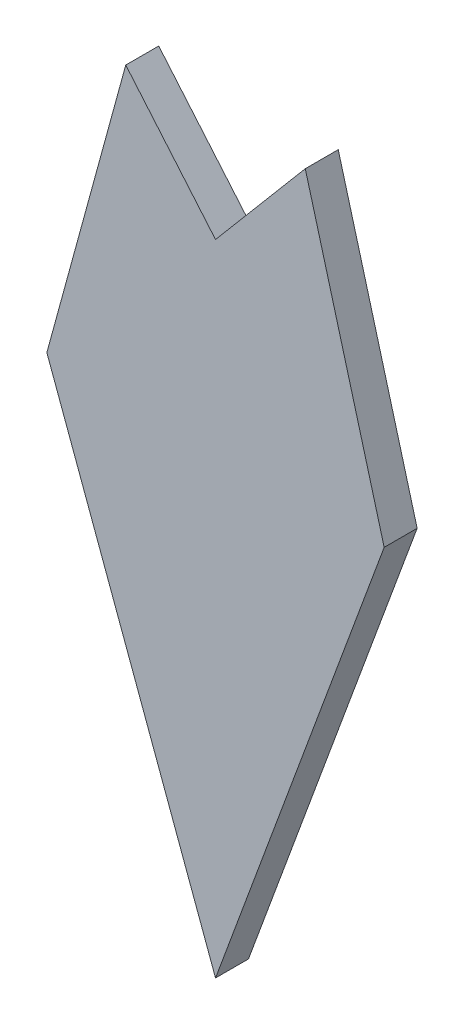
ISO-10303-21;
HEADER;
FILE_DESCRIPTION(('STEP AP214'),'2;1');
FILE_NAME('part.step','',(''),(''),'','','');
FILE_SCHEMA(('AUTOMOTIVE_DESIGN { 1 0 10303 214 1 1 1 1 }'));
ENDSEC;
DATA;
#1=APPLICATION_CONTEXT('core data for automotive mechanical design processes');
#2=APPLICATION_PROTOCOL_DEFINITION('international standard','automotive_design',2000,#1);
#3=PRODUCT_CONTEXT('',#1,'mechanical');
#4=PRODUCT('Part','Part','',(#3));
#5=PRODUCT_RELATED_PRODUCT_CATEGORY('part','',(#4));
#6=PRODUCT_DEFINITION_FORMATION('','',#4);
#7=PRODUCT_DEFINITION_CONTEXT('part definition',#1,'design');
#8=PRODUCT_DEFINITION('design','',#6,#7);
#9=PRODUCT_DEFINITION_SHAPE('','',#8);
#10=(LENGTH_UNIT() NAMED_UNIT(*) SI_UNIT(.MILLI.,.METRE.));
#11=(NAMED_UNIT(*) PLANE_ANGLE_UNIT() SI_UNIT($,.RADIAN.));
#12=(NAMED_UNIT(*) SI_UNIT($,.STERADIAN.) SOLID_ANGLE_UNIT());
#13=UNCERTAINTY_MEASURE_WITH_UNIT(LENGTH_MEASURE(1.E-05),#10,'distance_accuracy_value','');
#14=(GEOMETRIC_REPRESENTATION_CONTEXT(3) GLOBAL_UNCERTAINTY_ASSIGNED_CONTEXT((#13)) GLOBAL_UNIT_ASSIGNED_CONTEXT((#10,
#11,#12)) REPRESENTATION_CONTEXT('',''));
#15=CARTESIAN_POINT('',(0.,0.,0.));
#16=DIRECTION('',(0.,0.,1.));
#17=DIRECTION('',(1.,0.,0.));
#18=AXIS2_PLACEMENT_3D('',#15,#16,#17);
#19=CARTESIAN_POINT('',(28.0238736046993,7.66526392419233,0.5));
#20=DIRECTION('',(-0.964567933430015,-0.263834610691151,0.));
#21=DIRECTION('',(-0.263834610691151,0.964567933430015,0.));
#22=AXIS2_PLACEMENT_3D('',#19,#20,#21);
#23=PLANE('',#22);
#24=DIRECTION('',(-0.263834610691151,0.964567933430015,0.));
#25=VECTOR('',#24,1.);
#26=CARTESIAN_POINT('',(28.0238736046993,7.66526392419233,0.));
#27=LINE('',#26,#25);
#28=CARTESIAN_POINT('',(27.207956928254,10.6482200283522,0.));
#29=VERTEX_POINT('',#28);
#30=CARTESIAN_POINT('',(26.0112881478147,15.0231893681396,0.));
#31=VERTEX_POINT('',#30);
#32=EDGE_CURVE('E11',#29,#31,#27,.T.);
#33=ORIENTED_EDGE('',*,*,#32,.T.);
#34=DIRECTION('',(0.,0.,-1.));
#35=VECTOR('',#34,1.);
#36=CARTESIAN_POINT('',(26.0112881478147,15.0231893681396,0.5));
#37=LINE('',#36,#35);
#38=CARTESIAN_POINT('',(26.0112881478147,15.0231893681396,0.5));
#39=VERTEX_POINT('',#38);
#40=EDGE_CURVE('E42',#39,#31,#37,.T.);
#41=ORIENTED_EDGE('',*,*,#40,.F.);
#42=DIRECTION('',(-0.263834610691151,0.964567933430015,0.));
#43=VECTOR('',#42,1.);
#44=CARTESIAN_POINT('',(28.0238736046993,7.66526392419233,0.5));
#45=LINE('',#44,#43);
#46=CARTESIAN_POINT('',(27.207956928254,10.6482200283522,0.5));
#47=VERTEX_POINT('',#46);
#48=EDGE_CURVE('E105',#47,#39,#45,.T.);
#49=ORIENTED_EDGE('',*,*,#48,.F.);
#50=DIRECTION('',(0.,0.,-1.));
#51=VECTOR('',#50,1.);
#52=CARTESIAN_POINT('',(27.207956928254,10.6482200283522,0.5));
#53=LINE('',#52,#51);
#54=EDGE_CURVE('E27',#47,#29,#53,.T.);
#55=ORIENTED_EDGE('',*,*,#54,.T.);
#56=EDGE_LOOP('',(#33,#41,#49,#55));
#57=FACE_BOUND('',#56,.T.);
#58=ADVANCED_FACE('F16',(#57),#23,.F.);
#59=CARTESIAN_POINT('',(7.76929094611775,-6.56503269595258,0.5));
#60=DIRECTION('',(0.763821580087367,-0.6454274504488,0.));
#61=DIRECTION('',(0.,0.,-1.));
#62=AXIS2_PLACEMENT_3D('',#59,#60,#61);
#63=PLANE('',#62);
#64=DIRECTION('',(-0.6454274504488,-0.763821580087367,0.));
#65=VECTOR('',#64,1.);
#66=CARTESIAN_POINT('',(7.76929094611775,-6.56503269595258,0.));
#67=LINE('',#66,#65);
#68=CARTESIAN_POINT('',(24.65,13.4121930225471,0.));
#69=VERTEX_POINT('',#68);
#70=EDGE_CURVE('E87',#31,#69,#67,.T.);
#71=ORIENTED_EDGE('',*,*,#70,.T.);
#72=DIRECTION('',(0.,0.,-1.));
#73=VECTOR('',#72,1.);
#74=CARTESIAN_POINT('',(24.65,13.4121930225471,0.5));
#75=LINE('',#74,#73);
#76=CARTESIAN_POINT('',(24.65,13.4121930225471,0.5));
#77=VERTEX_POINT('',#76);
#78=EDGE_CURVE('E77',#77,#69,#75,.T.);
#79=ORIENTED_EDGE('',*,*,#78,.F.);
#80=DIRECTION('',(-0.6454274504488,-0.763821580087367,0.));
#81=VECTOR('',#80,1.);
#82=CARTESIAN_POINT('',(7.76929094611775,-6.56503269595258,0.5));
#83=LINE('',#82,#81);
#84=EDGE_CURVE('E104',#39,#77,#83,.T.);
#85=ORIENTED_EDGE('',*,*,#84,.F.);
#86=ORIENTED_EDGE('',*,*,#40,.T.);
#87=EDGE_LOOP('',(#71,#79,#85,#86));
#88=FACE_BOUND('',#87,.T.);
#89=ADVANCED_FACE('F88',(#88),#63,.F.);
#90=CARTESIAN_POINT('',(20.9934829798954,17.7394440652021,0.5));
#91=DIRECTION('',(-0.763821580087367,-0.6454274504488,0.));
#92=DIRECTION('',(-0.6454274504488,0.763821580087367,0.));
#93=AXIS2_PLACEMENT_3D('',#90,#91,#92);
#94=PLANE('',#93);
#95=DIRECTION('',(-0.6454274504488,0.763821580087367,0.));
#96=VECTOR('',#95,1.);
#97=CARTESIAN_POINT('',(20.9934829798954,17.7394440652021,0.));
#98=LINE('',#97,#96);
#99=CARTESIAN_POINT('',(23.2887118521852,15.0231893681396,0.));
#100=VERTEX_POINT('',#99);
#101=EDGE_CURVE('E81',#69,#100,#98,.T.);
#102=ORIENTED_EDGE('',*,*,#101,.T.);
#103=DIRECTION('',(0.,0.,-1.));
#104=VECTOR('',#103,1.);
#105=CARTESIAN_POINT('',(23.2887118521852,15.0231893681396,0.5));
#106=LINE('',#105,#104);
#107=CARTESIAN_POINT('',(23.2887118521852,15.0231893681396,0.5));
#108=VERTEX_POINT('',#107);
#109=EDGE_CURVE('E115',#108,#100,#106,.T.);
#110=ORIENTED_EDGE('',*,*,#109,.F.);
#111=DIRECTION('',(-0.6454274504488,0.763821580087367,0.));
#112=VECTOR('',#111,1.);
#113=CARTESIAN_POINT('',(20.9934829798954,17.7394440652021,0.5));
#114=LINE('',#113,#112);
#115=EDGE_CURVE('E83',#77,#108,#114,.T.);
#116=ORIENTED_EDGE('',*,*,#115,.F.);
#117=ORIENTED_EDGE('',*,*,#78,.T.);
#118=EDGE_LOOP('',(#102,#110,#116,#117));
#119=FACE_BOUND('',#118,.T.);
#120=ADVANCED_FACE('F78',(#119),#94,.F.);
#121=CARTESIAN_POINT('',(17.8444173966322,-4.88091585225029,0.5));
#122=DIRECTION('',(0.964567933430015,-0.263834610691151,0.));
#123=DIRECTION('',(0.,0.,-1.));
#124=AXIS2_PLACEMENT_3D('',#121,#122,#123);
#125=PLANE('',#124);
#126=DIRECTION('',(-0.263834610691151,-0.964567933430015,0.));
#127=VECTOR('',#126,1.);
#128=CARTESIAN_POINT('',(17.8444173966322,-4.88091585225029,0.));
#129=LINE('',#128,#127);
#130=CARTESIAN_POINT('',(22.0920430717459,10.6482200283522,0.));
#131=VERTEX_POINT('',#130);
#132=EDGE_CURVE('E20',#100,#131,#129,.T.);
#133=ORIENTED_EDGE('',*,*,#132,.T.);
#134=DIRECTION('',(0.,0.,-1.));
#135=VECTOR('',#134,1.);
#136=CARTESIAN_POINT('',(22.0920430717459,10.6482200283522,0.5));
#137=LINE('',#136,#135);
#138=CARTESIAN_POINT('',(22.0920430717459,10.6482200283522,0.5));
#139=VERTEX_POINT('',#138);
#140=EDGE_CURVE('E109',#139,#131,#137,.T.);
#141=ORIENTED_EDGE('',*,*,#140,.F.);
#142=DIRECTION('',(-0.263834610691151,-0.964567933430015,0.));
#143=VECTOR('',#142,1.);
#144=CARTESIAN_POINT('',(17.8444173966322,-4.88091585225029,0.5));
#145=LINE('',#144,#143);
#146=EDGE_CURVE('E122',#108,#139,#145,.T.);
#147=ORIENTED_EDGE('',*,*,#146,.F.);
#148=ORIENTED_EDGE('',*,*,#109,.T.);
#149=EDGE_LOOP('',(#133,#141,#147,#148));
#150=FACE_BOUND('',#149,.T.);
#151=ADVANCED_FACE('F171',(#150),#125,.F.);
#152=CARTESIAN_POINT('',(22.9036809197462,8.4476741883308,0.5));
#153=DIRECTION('',(0.938217136277078,0.346047114127598,0.));
#154=DIRECTION('',(0.,0.,-1.));
#155=AXIS2_PLACEMENT_3D('',#152,#153,#154);
#156=PLANE('',#155);
#157=DIRECTION('',(0.346047114127598,-0.938217136277078,0.));
#158=VECTOR('',#157,1.);
#159=CARTESIAN_POINT('',(22.9036809197462,8.4476741883308,0.));
#160=LINE('',#159,#158);
#161=CARTESIAN_POINT('',(24.65,3.71298223566914,0.));
#162=VERTEX_POINT('',#161);
#163=EDGE_CURVE('E113',#131,#162,#160,.T.);
#164=ORIENTED_EDGE('',*,*,#163,.T.);
#165=DIRECTION('',(0.,0.,-1.));
#166=VECTOR('',#165,1.);
#167=CARTESIAN_POINT('',(24.65,3.71298223566914,0.5));
#168=LINE('',#167,#166);
#169=CARTESIAN_POINT('',(24.65,3.71298223566914,0.5));
#170=VERTEX_POINT('',#169);
#171=EDGE_CURVE('E108',#170,#162,#168,.T.);
#172=ORIENTED_EDGE('',*,*,#171,.F.);
#173=DIRECTION('',(0.346047114127598,-0.938217136277078,0.));
#174=VECTOR('',#173,1.);
#175=CARTESIAN_POINT('',(22.9036809197462,8.4476741883308,0.5));
#176=LINE('',#175,#174);
#177=EDGE_CURVE('E140',#139,#170,#176,.T.);
#178=ORIENTED_EDGE('',*,*,#177,.F.);
#179=ORIENTED_EDGE('',*,*,#140,.T.);
#180=EDGE_LOOP('',(#164,#172,#178,#179));
#181=FACE_BOUND('',#180,.T.);
#182=ADVANCED_FACE('F152',(#181),#156,.F.);
#183=CARTESIAN_POINT('',(20.492712844089,-7.5584253006527,0.5));
#184=DIRECTION('',(-0.938217136277078,0.346047114127598,0.));
#185=DIRECTION('',(0.,0.,1.));
#186=AXIS2_PLACEMENT_3D('',#183,#184,#185);
#187=PLANE('',#186);
#188=DIRECTION('',(0.346047114127598,0.938217136277078,0.));
#189=VECTOR('',#188,1.);
#190=CARTESIAN_POINT('',(20.492712844089,-7.5584253006527,0.));
#191=LINE('',#190,#189);
#192=EDGE_CURVE('E114',#162,#29,#191,.T.);
#193=ORIENTED_EDGE('',*,*,#192,.T.);
#194=ORIENTED_EDGE('',*,*,#54,.F.);
#195=DIRECTION('',(0.346047114127598,0.938217136277078,0.));
#196=VECTOR('',#195,1.);
#197=CARTESIAN_POINT('',(20.492712844089,-7.5584253006527,0.5));
#198=LINE('',#197,#196);
#199=EDGE_CURVE('E144',#170,#47,#198,.T.);
#200=ORIENTED_EDGE('',*,*,#199,.F.);
#201=ORIENTED_EDGE('',*,*,#171,.T.);
#202=EDGE_LOOP('',(#193,#194,#200,#201));
#203=FACE_BOUND('',#202,.T.);
#204=ADVANCED_FACE('F157',(#203),#187,.F.);
#205=CARTESIAN_POINT('',(0.,0.,0.5));
#206=DIRECTION('',(0.,0.,1.));
#207=DIRECTION('',(1.,0.,0.));
#208=AXIS2_PLACEMENT_3D('',#205,#206,#207);
#209=PLANE('',#208);
#210=ORIENTED_EDGE('',*,*,#48,.T.);
#211=ORIENTED_EDGE('',*,*,#84,.T.);
#212=ORIENTED_EDGE('',*,*,#115,.T.);
#213=ORIENTED_EDGE('',*,*,#146,.T.);
#214=ORIENTED_EDGE('',*,*,#177,.T.);
#215=ORIENTED_EDGE('',*,*,#199,.T.);
#216=EDGE_LOOP('',(#210,#211,#212,#213,#214,#215));
#217=FACE_BOUND('',#216,.T.);
#218=ADVANCED_FACE('F18',(#217),#209,.T.);
#219=CARTESIAN_POINT('',(0.,0.,0.));
#220=DIRECTION('',(0.,0.,1.));
#221=DIRECTION('',(1.,0.,0.));
#222=AXIS2_PLACEMENT_3D('',#219,#220,#221);
#223=PLANE('',#222);
#224=ORIENTED_EDGE('',*,*,#32,.F.);
#225=ORIENTED_EDGE('',*,*,#192,.F.);
#226=ORIENTED_EDGE('',*,*,#163,.F.);
#227=ORIENTED_EDGE('',*,*,#132,.F.);
#228=ORIENTED_EDGE('',*,*,#101,.F.);
#229=ORIENTED_EDGE('',*,*,#70,.F.);
#230=EDGE_LOOP('',(#224,#225,#226,#227,#228,#229));
#231=FACE_BOUND('',#230,.T.);
#232=ADVANCED_FACE('F92',(#231),#223,.F.);
#233=CLOSED_SHELL('',(#58,#89,#120,#151,#182,#204,#218,#232));
#234=MANIFOLD_SOLID_BREP('B1',#233);
#235=ADVANCED_BREP_SHAPE_REPRESENTATION('',(#18,#234),#14);
#236=SHAPE_DEFINITION_REPRESENTATION(#9,#235);
ENDSEC;
END-ISO-10303-21;
